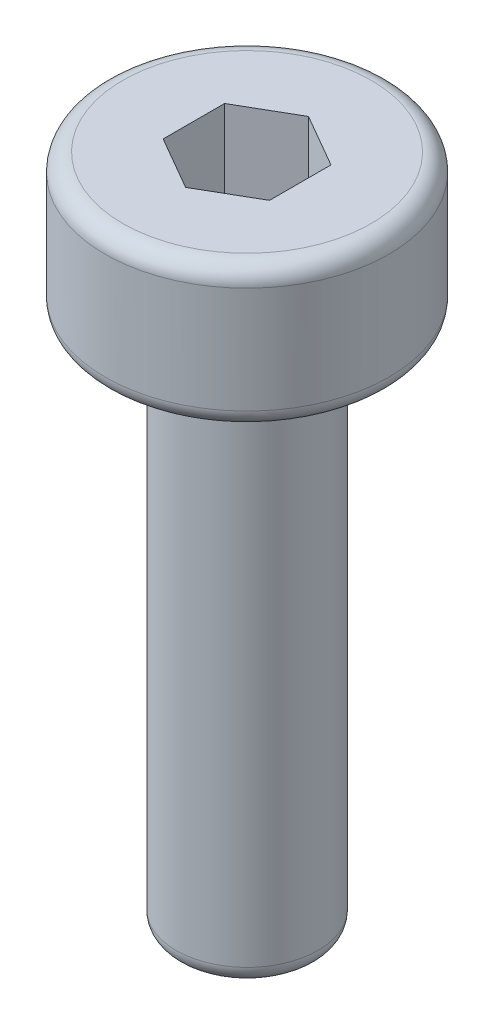
ISO-10303-21;
HEADER;
FILE_DESCRIPTION(('STEP AP214'),'2;1');
FILE_NAME('part.step','',(''),(''),'','','');
FILE_SCHEMA(('AUTOMOTIVE_DESIGN { 1 0 10303 214 1 1 1 1 }'));
ENDSEC;
DATA;
#1=APPLICATION_CONTEXT('core data for automotive mechanical design processes');
#2=APPLICATION_PROTOCOL_DEFINITION('international standard','automotive_design',2000,#1);
#3=PRODUCT_CONTEXT('',#1,'mechanical');
#4=PRODUCT('Part','Part','',(#3));
#5=PRODUCT_RELATED_PRODUCT_CATEGORY('part','',(#4));
#6=PRODUCT_DEFINITION_FORMATION('','',#4);
#7=PRODUCT_DEFINITION_CONTEXT('part definition',#1,'design');
#8=PRODUCT_DEFINITION('design','',#6,#7);
#9=PRODUCT_DEFINITION_SHAPE('','',#8);
#10=(LENGTH_UNIT() NAMED_UNIT(*) SI_UNIT(.MILLI.,.METRE.));
#11=(NAMED_UNIT(*) PLANE_ANGLE_UNIT() SI_UNIT($,.RADIAN.));
#12=(NAMED_UNIT(*) SI_UNIT($,.STERADIAN.) SOLID_ANGLE_UNIT());
#13=UNCERTAINTY_MEASURE_WITH_UNIT(LENGTH_MEASURE(1.E-05),#10,'distance_accuracy_value','');
#14=(GEOMETRIC_REPRESENTATION_CONTEXT(3) GLOBAL_UNCERTAINTY_ASSIGNED_CONTEXT((#13)) GLOBAL_UNIT_ASSIGNED_CONTEXT((#10,
#11,#12)) REPRESENTATION_CONTEXT('',''));
#15=CARTESIAN_POINT('',(0.,0.,0.));
#16=DIRECTION('',(0.,0.,1.));
#17=DIRECTION('',(1.,0.,0.));
#18=AXIS2_PLACEMENT_3D('',#15,#16,#17);
#19=CARTESIAN_POINT('',(-2.,-9.5,0.));
#20=DIRECTION('',(0.,1.,0.));
#21=DIRECTION('',(0.,0.,1.));
#22=AXIS2_PLACEMENT_3D('',#19,#20,#21);
#23=PLANE('',#22);
#24=CARTESIAN_POINT('',(0.,-9.5,0.));
#25=DIRECTION('',(0.,1.,0.));
#26=DIRECTION('',(0.,0.,1.));
#27=AXIS2_PLACEMENT_3D('',#24,#25,#26);
#28=CIRCLE('',#27,1.5);
#29=CARTESIAN_POINT('',(0.,-9.5,1.5));
#30=VERTEX_POINT('',#29);
#31=EDGE_CURVE('E171',#30,#30,#28,.F.);
#32=ORIENTED_EDGE('',*,*,#31,.T.);
#33=EDGE_LOOP('',(#32));
#34=FACE_BOUND('',#33,.T.);
#35=ADVANCED_FACE('F35',(#34),#23,.F.);
#36=CARTESIAN_POINT('',(0.,9.5,0.));
#37=DIRECTION('',(0.,-1.,0.));
#38=DIRECTION('',(0.,0.,-1.));
#39=AXIS2_PLACEMENT_3D('',#36,#37,#38);
#40=PLANE('',#39);
#41=CARTESIAN_POINT('',(0.,9.5,0.));
#42=DIRECTION('',(0.,-1.,0.));
#43=DIRECTION('',(0.,0.,-1.));
#44=AXIS2_PLACEMENT_3D('',#41,#42,#43);
#45=CIRCLE('',#44,3.5);
#46=CARTESIAN_POINT('',(0.,9.5,-3.5));
#47=VERTEX_POINT('',#46);
#48=EDGE_CURVE('E11',#47,#47,#45,.F.);
#49=ORIENTED_EDGE('',*,*,#48,.T.);
#50=EDGE_LOOP('',(#49));
#51=FACE_BOUND('',#50,.T.);
#52=DIRECTION('',(0.,0.,-1.));
#53=VECTOR('',#52,1.);
#54=CARTESIAN_POINT('',(1.5,9.5,0.86602540378444));
#55=LINE('',#54,#53);
#56=CARTESIAN_POINT('',(1.5,9.5,0.86602540378444));
#57=VERTEX_POINT('',#56);
#58=CARTESIAN_POINT('',(1.5,9.5,-0.86602540378444));
#59=VERTEX_POINT('',#58);
#60=EDGE_CURVE('E118',#57,#59,#55,.T.);
#61=ORIENTED_EDGE('',*,*,#60,.F.);
#62=DIRECTION('',(0.866025403784439,0.,-0.5));
#63=VECTOR('',#62,1.);
#64=CARTESIAN_POINT('',(0.,9.5,1.73205080756888));
#65=LINE('',#64,#63);
#66=CARTESIAN_POINT('',(0.,9.5,1.73205080756888));
#67=VERTEX_POINT('',#66);
#68=EDGE_CURVE('E123',#67,#57,#65,.T.);
#69=ORIENTED_EDGE('',*,*,#68,.F.);
#70=DIRECTION('',(0.866025403784439,0.,0.5));
#71=VECTOR('',#70,1.);
#72=CARTESIAN_POINT('',(-1.5,9.5,0.866025403784439));
#73=LINE('',#72,#71);
#74=CARTESIAN_POINT('',(-1.5,9.5,0.866025403784439));
#75=VERTEX_POINT('',#74);
#76=EDGE_CURVE('E136',#75,#67,#73,.T.);
#77=ORIENTED_EDGE('',*,*,#76,.F.);
#78=DIRECTION('',(0.,0.,1.));
#79=VECTOR('',#78,1.);
#80=CARTESIAN_POINT('',(-1.5,9.5,-0.86602540378444));
#81=LINE('',#80,#79);
#82=CARTESIAN_POINT('',(-1.5,9.5,-0.86602540378444));
#83=VERTEX_POINT('',#82);
#84=EDGE_CURVE('E130',#83,#75,#81,.T.);
#85=ORIENTED_EDGE('',*,*,#84,.F.);
#86=DIRECTION('',(-0.866025403784439,0.,0.5));
#87=VECTOR('',#86,1.);
#88=CARTESIAN_POINT('',(0.,9.5,-1.73205080756888));
#89=LINE('',#88,#87);
#90=CARTESIAN_POINT('',(0.,9.5,-1.73205080756888));
#91=VERTEX_POINT('',#90);
#92=EDGE_CURVE('E128',#91,#83,#89,.T.);
#93=ORIENTED_EDGE('',*,*,#92,.F.);
#94=DIRECTION('',(-0.866025403784439,0.,-0.5));
#95=VECTOR('',#94,1.);
#96=CARTESIAN_POINT('',(1.5,9.5,-0.86602540378444));
#97=LINE('',#96,#95);
#98=EDGE_CURVE('E111',#59,#91,#97,.T.);
#99=ORIENTED_EDGE('',*,*,#98,.F.);
#100=EDGE_LOOP('',(#61,#69,#77,#85,#93,#99));
#101=FACE_BOUND('',#100,.T.);
#102=ADVANCED_FACE('F125',(#51,#101),#40,.F.);
#103=CARTESIAN_POINT('',(0.,-9.5,0.));
#104=DIRECTION('',(0.,-1.,0.));
#105=DIRECTION('',(0.,0.,-1.));
#106=AXIS2_PLACEMENT_3D('',#103,#104,#105);
#107=CYLINDRICAL_SURFACE('',#106,4.);
#108=CARTESIAN_POINT('',(0.,6.,0.));
#109=DIRECTION('',(0.,1.,0.));
#110=DIRECTION('',(0.,0.,1.));
#111=AXIS2_PLACEMENT_3D('',#108,#109,#110);
#112=CIRCLE('',#111,4.);
#113=CARTESIAN_POINT('',(0.,6.,4.));
#114=VERTEX_POINT('',#113);
#115=EDGE_CURVE('E44',#114,#114,#112,.T.);
#116=ORIENTED_EDGE('',*,*,#115,.T.);
#117=EDGE_LOOP('',(#116));
#118=FACE_BOUND('',#117,.T.);
#119=CARTESIAN_POINT('',(0.,9.,0.));
#120=DIRECTION('',(0.,-1.,0.));
#121=DIRECTION('',(0.,0.,-1.));
#122=AXIS2_PLACEMENT_3D('',#119,#120,#121);
#123=CIRCLE('',#122,4.);
#124=CARTESIAN_POINT('',(0.,9.,-4.));
#125=VERTEX_POINT('',#124);
#126=EDGE_CURVE('E186',#125,#125,#123,.T.);
#127=ORIENTED_EDGE('',*,*,#126,.T.);
#128=EDGE_LOOP('',(#127));
#129=FACE_BOUND('',#128,.T.);
#130=ADVANCED_FACE('F259',(#118,#129),#107,.T.);
#131=CARTESIAN_POINT('',(-4.,5.5,0.));
#132=DIRECTION('',(0.,1.,0.));
#133=DIRECTION('',(0.,0.,1.));
#134=AXIS2_PLACEMENT_3D('',#131,#132,#133);
#135=PLANE('',#134);
#136=CARTESIAN_POINT('',(0.,5.5,0.));
#137=DIRECTION('',(0.,1.,0.));
#138=DIRECTION('',(0.,0.,1.));
#139=AXIS2_PLACEMENT_3D('',#136,#137,#138);
#140=CIRCLE('',#139,2.5);
#141=CARTESIAN_POINT('',(0.,5.5,2.5));
#142=VERTEX_POINT('',#141);
#143=EDGE_CURVE('E183',#142,#142,#140,.T.);
#144=ORIENTED_EDGE('',*,*,#143,.T.);
#145=EDGE_LOOP('',(#144));
#146=FACE_BOUND('',#145,.T.);
#147=CARTESIAN_POINT('',(0.,5.5,0.));
#148=DIRECTION('',(0.,1.,0.));
#149=DIRECTION('',(0.,0.,1.));
#150=AXIS2_PLACEMENT_3D('',#147,#148,#149);
#151=CIRCLE('',#150,3.5);
#152=CARTESIAN_POINT('',(0.,5.5,3.5));
#153=VERTEX_POINT('',#152);
#154=EDGE_CURVE('E180',#153,#153,#151,.F.);
#155=ORIENTED_EDGE('',*,*,#154,.T.);
#156=EDGE_LOOP('',(#155));
#157=FACE_BOUND('',#156,.T.);
#158=ADVANCED_FACE('F292',(#146,#157),#135,.F.);
#159=CARTESIAN_POINT('',(0.,-9.5,0.));
#160=DIRECTION('',(0.,-1.,0.));
#161=DIRECTION('',(0.,0.,-1.));
#162=AXIS2_PLACEMENT_3D('',#159,#160,#161);
#163=CYLINDRICAL_SURFACE('',#162,2.);
#164=CARTESIAN_POINT('',(0.,-9.,0.));
#165=DIRECTION('',(0.,1.,0.));
#166=DIRECTION('',(0.,0.,1.));
#167=AXIS2_PLACEMENT_3D('',#164,#165,#166);
#168=CIRCLE('',#167,2.);
#169=CARTESIAN_POINT('',(0.,-9.,2.));
#170=VERTEX_POINT('',#169);
#171=EDGE_CURVE('E177',#170,#170,#168,.T.);
#172=ORIENTED_EDGE('',*,*,#171,.T.);
#173=EDGE_LOOP('',(#172));
#174=FACE_BOUND('',#173,.T.);
#175=CARTESIAN_POINT('',(0.,5.,0.));
#176=DIRECTION('',(0.,1.,0.));
#177=DIRECTION('',(0.,0.,1.));
#178=AXIS2_PLACEMENT_3D('',#175,#176,#177);
#179=CIRCLE('',#178,2.);
#180=CARTESIAN_POINT('',(0.,5.,2.));
#181=VERTEX_POINT('',#180);
#182=EDGE_CURVE('E174',#181,#181,#179,.F.);
#183=ORIENTED_EDGE('',*,*,#182,.T.);
#184=EDGE_LOOP('',(#183));
#185=FACE_BOUND('',#184,.T.);
#186=ADVANCED_FACE('F294',(#174,#185),#163,.T.);
#187=CARTESIAN_POINT('',(0.,3.5,1.73205080756888));
#188=DIRECTION('',(0.5,0.,0.866025403784439));
#189=DIRECTION('',(0.866025403784439,0.,-0.5));
#190=AXIS2_PLACEMENT_3D('',#187,#188,#189);
#191=PLANE('',#190);
#192=DIRECTION('',(0.,1.,0.));
#193=VECTOR('',#192,1.);
#194=CARTESIAN_POINT('',(1.5,3.5,0.86602540378444));
#195=LINE('',#194,#193);
#196=CARTESIAN_POINT('',(1.5,4.,0.86602540378444));
#197=VERTEX_POINT('',#196);
#198=EDGE_CURVE('E115',#197,#57,#195,.T.);
#199=ORIENTED_EDGE('',*,*,#198,.F.);
#200=DIRECTION('',(0.866025403784439,0.,-0.5));
#201=VECTOR('',#200,1.);
#202=CARTESIAN_POINT('',(0.,4.,1.73205080756888));
#203=LINE('',#202,#201);
#204=CARTESIAN_POINT('',(0.,4.,1.73205080756888));
#205=VERTEX_POINT('',#204);
#206=EDGE_CURVE('E169',#197,#205,#203,.F.);
#207=ORIENTED_EDGE('',*,*,#206,.T.);
#208=DIRECTION('',(0.,1.,0.));
#209=VECTOR('',#208,1.);
#210=CARTESIAN_POINT('',(0.,3.5,1.73205080756888));
#211=LINE('',#210,#209);
#212=EDGE_CURVE('E139',#205,#67,#211,.T.);
#213=ORIENTED_EDGE('',*,*,#212,.T.);
#214=ORIENTED_EDGE('',*,*,#68,.T.);
#215=EDGE_LOOP('',(#199,#207,#213,#214));
#216=FACE_BOUND('',#215,.T.);
#217=ADVANCED_FACE('F210',(#216),#191,.F.);
#218=CARTESIAN_POINT('',(-1.5,3.5,0.866025403784439));
#219=DIRECTION('',(-0.5,0.,0.866025403784439));
#220=DIRECTION('',(0.866025403784439,0.,0.5));
#221=AXIS2_PLACEMENT_3D('',#218,#219,#220);
#222=PLANE('',#221);
#223=ORIENTED_EDGE('',*,*,#212,.F.);
#224=DIRECTION('',(0.866025403784439,0.,0.5));
#225=VECTOR('',#224,1.);
#226=CARTESIAN_POINT('',(-1.5,4.,0.866025403784439));
#227=LINE('',#226,#225);
#228=CARTESIAN_POINT('',(-1.5,4.,0.866025403784439));
#229=VERTEX_POINT('',#228);
#230=EDGE_CURVE('E160',#205,#229,#227,.F.);
#231=ORIENTED_EDGE('',*,*,#230,.T.);
#232=DIRECTION('',(0.,1.,0.));
#233=VECTOR('',#232,1.);
#234=CARTESIAN_POINT('',(-1.5,3.5,0.866025403784439));
#235=LINE('',#234,#233);
#236=EDGE_CURVE('E142',#229,#75,#235,.T.);
#237=ORIENTED_EDGE('',*,*,#236,.T.);
#238=ORIENTED_EDGE('',*,*,#76,.T.);
#239=EDGE_LOOP('',(#223,#231,#237,#238));
#240=FACE_BOUND('',#239,.T.);
#241=ADVANCED_FACE('F215',(#240),#222,.F.);
#242=CARTESIAN_POINT('',(-1.5,3.5,-0.86602540378444));
#243=DIRECTION('',(-1.,0.,0.));
#244=DIRECTION('',(0.,0.,1.));
#245=AXIS2_PLACEMENT_3D('',#242,#243,#244);
#246=PLANE('',#245);
#247=ORIENTED_EDGE('',*,*,#236,.F.);
#248=DIRECTION('',(0.,0.,1.));
#249=VECTOR('',#248,1.);
#250=CARTESIAN_POINT('',(-1.5,4.,-0.86602540378444));
#251=LINE('',#250,#249);
#252=CARTESIAN_POINT('',(-1.5,4.,-0.86602540378444));
#253=VERTEX_POINT('',#252);
#254=EDGE_CURVE('E163',#229,#253,#251,.F.);
#255=ORIENTED_EDGE('',*,*,#254,.T.);
#256=DIRECTION('',(0.,1.,0.));
#257=VECTOR('',#256,1.);
#258=CARTESIAN_POINT('',(-1.5,3.5,-0.86602540378444));
#259=LINE('',#258,#257);
#260=EDGE_CURVE('E144',#253,#83,#259,.T.);
#261=ORIENTED_EDGE('',*,*,#260,.T.);
#262=ORIENTED_EDGE('',*,*,#84,.T.);
#263=EDGE_LOOP('',(#247,#255,#261,#262));
#264=FACE_BOUND('',#263,.T.);
#265=ADVANCED_FACE('F219',(#264),#246,.F.);
#266=CARTESIAN_POINT('',(0.,3.5,-1.73205080756888));
#267=DIRECTION('',(-0.5,0.,-0.866025403784438));
#268=DIRECTION('',(-0.866025403784439,0.,0.5));
#269=AXIS2_PLACEMENT_3D('',#266,#267,#268);
#270=PLANE('',#269);
#271=ORIENTED_EDGE('',*,*,#260,.F.);
#272=DIRECTION('',(-0.866025403784439,0.,0.5));
#273=VECTOR('',#272,1.);
#274=CARTESIAN_POINT('',(0.,4.,-1.73205080756888));
#275=LINE('',#274,#273);
#276=CARTESIAN_POINT('',(0.,4.,-1.73205080756888));
#277=VERTEX_POINT('',#276);
#278=EDGE_CURVE('E165',#253,#277,#275,.F.);
#279=ORIENTED_EDGE('',*,*,#278,.T.);
#280=DIRECTION('',(0.,1.,0.));
#281=VECTOR('',#280,1.);
#282=CARTESIAN_POINT('',(0.,3.5,-1.73205080756888));
#283=LINE('',#282,#281);
#284=EDGE_CURVE('E114',#277,#91,#283,.T.);
#285=ORIENTED_EDGE('',*,*,#284,.T.);
#286=ORIENTED_EDGE('',*,*,#92,.T.);
#287=EDGE_LOOP('',(#271,#279,#285,#286));
#288=FACE_BOUND('',#287,.T.);
#289=ADVANCED_FACE('F223',(#288),#270,.F.);
#290=CARTESIAN_POINT('',(1.5,3.5,-0.86602540378444));
#291=DIRECTION('',(0.5,0.,-0.866025403784439));
#292=DIRECTION('',(-0.866025403784439,0.,-0.5));
#293=AXIS2_PLACEMENT_3D('',#290,#291,#292);
#294=PLANE('',#293);
#295=ORIENTED_EDGE('',*,*,#284,.F.);
#296=DIRECTION('',(-0.866025403784439,0.,-0.5));
#297=VECTOR('',#296,1.);
#298=CARTESIAN_POINT('',(1.5,4.,-0.86602540378444));
#299=LINE('',#298,#297);
#300=CARTESIAN_POINT('',(1.5,4.,-0.86602540378444));
#301=VERTEX_POINT('',#300);
#302=EDGE_CURVE('E60',#277,#301,#299,.F.);
#303=ORIENTED_EDGE('',*,*,#302,.T.);
#304=DIRECTION('',(0.,1.,0.));
#305=VECTOR('',#304,1.);
#306=CARTESIAN_POINT('',(1.5,3.5,-0.86602540378444));
#307=LINE('',#306,#305);
#308=EDGE_CURVE('E107',#301,#59,#307,.T.);
#309=ORIENTED_EDGE('',*,*,#308,.T.);
#310=ORIENTED_EDGE('',*,*,#98,.T.);
#311=EDGE_LOOP('',(#295,#303,#309,#310));
#312=FACE_BOUND('',#311,.T.);
#313=ADVANCED_FACE('F109',(#312),#294,.F.);
#314=CARTESIAN_POINT('',(1.5,3.5,0.86602540378444));
#315=DIRECTION('',(1.,0.,0.));
#316=DIRECTION('',(0.,0.,-1.));
#317=AXIS2_PLACEMENT_3D('',#314,#315,#316);
#318=PLANE('',#317);
#319=ORIENTED_EDGE('',*,*,#308,.F.);
#320=DIRECTION('',(0.,0.,-1.));
#321=VECTOR('',#320,1.);
#322=CARTESIAN_POINT('',(1.5,4.,0.86602540378444));
#323=LINE('',#322,#321);
#324=EDGE_CURVE('E52',#301,#197,#323,.F.);
#325=ORIENTED_EDGE('',*,*,#324,.T.);
#326=ORIENTED_EDGE('',*,*,#198,.T.);
#327=ORIENTED_EDGE('',*,*,#60,.T.);
#328=EDGE_LOOP('',(#319,#325,#326,#327));
#329=FACE_BOUND('',#328,.T.);
#330=ADVANCED_FACE('F119',(#329),#318,.F.);
#331=CARTESIAN_POINT('',(0.,3.5,0.));
#332=DIRECTION('',(0.,1.,0.));
#333=DIRECTION('',(0.,0.,1.));
#334=AXIS2_PLACEMENT_3D('',#331,#332,#333);
#335=PLANE('',#334);
#336=DIRECTION('',(0.,0.,1.));
#337=VECTOR('',#336,1.);
#338=CARTESIAN_POINT('',(-1.,3.5,0.));
#339=LINE('',#338,#337);
#340=CARTESIAN_POINT('',(-1.,3.5,-0.577350269189627));
#341=VERTEX_POINT('',#340);
#342=CARTESIAN_POINT('',(-1.,3.5,0.577350269189626));
#343=VERTEX_POINT('',#342);
#344=EDGE_CURVE('E155',#341,#343,#339,.T.);
#345=ORIENTED_EDGE('',*,*,#344,.T.);
#346=DIRECTION('',(0.866025403784439,0.,0.5));
#347=VECTOR('',#346,1.);
#348=CARTESIAN_POINT('',(-0.5,3.5,0.866025403784439));
#349=LINE('',#348,#347);
#350=CARTESIAN_POINT('',(0.,3.5,1.15470053837925));
#351=VERTEX_POINT('',#350);
#352=EDGE_CURVE('E157',#343,#351,#349,.T.);
#353=ORIENTED_EDGE('',*,*,#352,.T.);
#354=DIRECTION('',(0.866025403784439,0.,-0.5));
#355=VECTOR('',#354,1.);
#356=CARTESIAN_POINT('',(0.5,3.5,0.866025403784439));
#357=LINE('',#356,#355);
#358=CARTESIAN_POINT('',(1.,3.5,0.577350269189627));
#359=VERTEX_POINT('',#358);
#360=EDGE_CURVE('E141',#351,#359,#357,.T.);
#361=ORIENTED_EDGE('',*,*,#360,.T.);
#362=DIRECTION('',(0.,0.,-1.));
#363=VECTOR('',#362,1.);
#364=CARTESIAN_POINT('',(1.,3.5,0.));
#365=LINE('',#364,#363);
#366=CARTESIAN_POINT('',(1.,3.5,-0.577350269189627));
#367=VERTEX_POINT('',#366);
#368=EDGE_CURVE('E149',#359,#367,#365,.T.);
#369=ORIENTED_EDGE('',*,*,#368,.T.);
#370=DIRECTION('',(-0.866025403784439,0.,-0.5));
#371=VECTOR('',#370,1.);
#372=CARTESIAN_POINT('',(0.500000000000001,3.5,-0.86602540378444));
#373=LINE('',#372,#371);
#374=CARTESIAN_POINT('',(0.,3.5,-1.15470053837925));
#375=VERTEX_POINT('',#374);
#376=EDGE_CURVE('E151',#367,#375,#373,.T.);
#377=ORIENTED_EDGE('',*,*,#376,.T.);
#378=DIRECTION('',(-0.866025403784439,0.,0.5));
#379=VECTOR('',#378,1.);
#380=CARTESIAN_POINT('',(-0.500000000000001,3.5,-0.86602540378444));
#381=LINE('',#380,#379);
#382=EDGE_CURVE('E153',#375,#341,#381,.T.);
#383=ORIENTED_EDGE('',*,*,#382,.T.);
#384=EDGE_LOOP('',(#345,#353,#361,#369,#377,#383));
#385=FACE_BOUND('',#384,.T.);
#386=ADVANCED_FACE('F243',(#385),#335,.T.);
#387=CARTESIAN_POINT('',(0.500000000000001,4.,-0.86602540378444));
#388=DIRECTION('',(-0.866025403784439,0.,-0.5));
#389=DIRECTION('',(-0.5,0.,0.866025403784439));
#390=AXIS2_PLACEMENT_3D('',#387,#388,#389);
#391=CYLINDRICAL_SURFACE('',#390,0.5);
#392=CARTESIAN_POINT('',(1.,4.,-0.577350269189627));
#393=DIRECTION('',(-0.5,0.,-0.866025403784439));
#394=DIRECTION('',(-0.866025403784439,0.,0.5));
#395=AXIS2_PLACEMENT_3D('',#392,#393,#394);
#396=ELLIPSE('',#395,0.577350269189626,0.5);
#397=EDGE_CURVE('E200',#301,#367,#396,.T.);
#398=ORIENTED_EDGE('',*,*,#397,.F.);
#399=ORIENTED_EDGE('',*,*,#302,.F.);
#400=CARTESIAN_POINT('',(0.,4.,-1.15470053837925));
#401=DIRECTION('',(-1.,0.,0.));
#402=DIRECTION('',(0.,0.,1.));
#403=AXIS2_PLACEMENT_3D('',#400,#401,#402);
#404=ELLIPSE('',#403,0.577350269189626,0.5);
#405=EDGE_CURVE('E39',#375,#277,#404,.F.);
#406=ORIENTED_EDGE('',*,*,#405,.F.);
#407=ORIENTED_EDGE('',*,*,#376,.F.);
#408=EDGE_LOOP('',(#398,#399,#406,#407));
#409=FACE_BOUND('',#408,.T.);
#410=ADVANCED_FACE('F225',(#409),#391,.F.);
#411=CARTESIAN_POINT('',(-0.500000000000001,4.,-0.86602540378444));
#412=DIRECTION('',(-0.866025403784439,0.,0.5));
#413=DIRECTION('',(0.5,0.,0.866025403784439));
#414=AXIS2_PLACEMENT_3D('',#411,#412,#413);
#415=CYLINDRICAL_SURFACE('',#414,0.5);
#416=ORIENTED_EDGE('',*,*,#405,.T.);
#417=ORIENTED_EDGE('',*,*,#278,.F.);
#418=CARTESIAN_POINT('',(-1.,4.,-0.577350269189627));
#419=DIRECTION('',(-0.5,0.,0.866025403784439));
#420=DIRECTION('',(0.866025403784439,0.,0.5));
#421=AXIS2_PLACEMENT_3D('',#418,#419,#420);
#422=ELLIPSE('',#421,0.577350269189626,0.5);
#423=EDGE_CURVE('E198',#341,#253,#422,.F.);
#424=ORIENTED_EDGE('',*,*,#423,.F.);
#425=ORIENTED_EDGE('',*,*,#382,.F.);
#426=EDGE_LOOP('',(#416,#417,#424,#425));
#427=FACE_BOUND('',#426,.T.);
#428=ADVANCED_FACE('F241',(#427),#415,.F.);
#429=CARTESIAN_POINT('',(1.,4.,0.));
#430=DIRECTION('',(0.,0.,-1.));
#431=DIRECTION('',(-1.,0.,0.));
#432=AXIS2_PLACEMENT_3D('',#429,#430,#431);
#433=CYLINDRICAL_SURFACE('',#432,0.5);
#434=ORIENTED_EDGE('',*,*,#397,.T.);
#435=ORIENTED_EDGE('',*,*,#368,.F.);
#436=CARTESIAN_POINT('',(1.,4.,0.577350269189627));
#437=DIRECTION('',(0.5,0.,-0.866025403784439));
#438=DIRECTION('',(-0.866025403784439,0.,-0.5));
#439=AXIS2_PLACEMENT_3D('',#436,#437,#438);
#440=ELLIPSE('',#439,0.577350269189626,0.5);
#441=EDGE_CURVE('E195',#197,#359,#440,.T.);
#442=ORIENTED_EDGE('',*,*,#441,.F.);
#443=ORIENTED_EDGE('',*,*,#324,.F.);
#444=EDGE_LOOP('',(#434,#435,#442,#443));
#445=FACE_BOUND('',#444,.T.);
#446=ADVANCED_FACE('F227',(#445),#433,.F.);
#447=CARTESIAN_POINT('',(-1.,4.,0.));
#448=DIRECTION('',(0.,0.,1.));
#449=DIRECTION('',(1.,0.,0.));
#450=AXIS2_PLACEMENT_3D('',#447,#448,#449);
#451=CYLINDRICAL_SURFACE('',#450,0.5);
#452=ORIENTED_EDGE('',*,*,#423,.T.);
#453=ORIENTED_EDGE('',*,*,#254,.F.);
#454=CARTESIAN_POINT('',(-1.,4.,0.577350269189626));
#455=DIRECTION('',(0.5,0.,0.866025403784439));
#456=DIRECTION('',(0.866025403784439,0.,-0.5));
#457=AXIS2_PLACEMENT_3D('',#454,#455,#456);
#458=ELLIPSE('',#457,0.577350269189626,0.5);
#459=EDGE_CURVE('E193',#343,#229,#458,.F.);
#460=ORIENTED_EDGE('',*,*,#459,.F.);
#461=ORIENTED_EDGE('',*,*,#344,.F.);
#462=EDGE_LOOP('',(#452,#453,#460,#461));
#463=FACE_BOUND('',#462,.T.);
#464=ADVANCED_FACE('F239',(#463),#451,.F.);
#465=CARTESIAN_POINT('',(0.5,4.,0.866025403784439));
#466=DIRECTION('',(0.866025403784439,0.,-0.5));
#467=DIRECTION('',(-0.5,0.,-0.866025403784439));
#468=AXIS2_PLACEMENT_3D('',#465,#466,#467);
#469=CYLINDRICAL_SURFACE('',#468,0.5);
#470=ORIENTED_EDGE('',*,*,#441,.T.);
#471=ORIENTED_EDGE('',*,*,#360,.F.);
#472=CARTESIAN_POINT('',(0.,4.,1.15470053837925));
#473=DIRECTION('',(1.,0.,0.));
#474=DIRECTION('',(0.,0.,1.));
#475=AXIS2_PLACEMENT_3D('',#472,#473,#474);
#476=ELLIPSE('',#475,0.577350269189626,0.5);
#477=EDGE_CURVE('E191',#205,#351,#476,.T.);
#478=ORIENTED_EDGE('',*,*,#477,.F.);
#479=ORIENTED_EDGE('',*,*,#206,.F.);
#480=EDGE_LOOP('',(#470,#471,#478,#479));
#481=FACE_BOUND('',#480,.T.);
#482=ADVANCED_FACE('F232',(#481),#469,.F.);
#483=CARTESIAN_POINT('',(-0.5,4.,0.866025403784439));
#484=DIRECTION('',(0.866025403784439,0.,0.5));
#485=DIRECTION('',(0.5,0.,-0.866025403784439));
#486=AXIS2_PLACEMENT_3D('',#483,#484,#485);
#487=CYLINDRICAL_SURFACE('',#486,0.5);
#488=ORIENTED_EDGE('',*,*,#459,.T.);
#489=ORIENTED_EDGE('',*,*,#230,.F.);
#490=ORIENTED_EDGE('',*,*,#477,.T.);
#491=ORIENTED_EDGE('',*,*,#352,.F.);
#492=EDGE_LOOP('',(#488,#489,#490,#491));
#493=FACE_BOUND('',#492,.T.);
#494=ADVANCED_FACE('F235',(#493),#487,.F.);
#495=CARTESIAN_POINT('',(0.,-9.,0.));
#496=DIRECTION('',(0.,1.,0.));
#497=DIRECTION('',(0.,0.,1.));
#498=AXIS2_PLACEMENT_3D('',#495,#496,#497);
#499=TOROIDAL_SURFACE('',#498,1.5,0.5);
#500=ORIENTED_EDGE('',*,*,#171,.F.);
#501=EDGE_LOOP('',(#500));
#502=FACE_BOUND('',#501,.T.);
#503=ORIENTED_EDGE('',*,*,#31,.F.);
#504=EDGE_LOOP('',(#503));
#505=FACE_BOUND('',#504,.T.);
#506=ADVANCED_FACE('F266',(#502,#505),#499,.T.);
#507=CARTESIAN_POINT('',(0.,5.,0.));
#508=DIRECTION('',(0.,1.,0.));
#509=DIRECTION('',(0.,0.,1.));
#510=AXIS2_PLACEMENT_3D('',#507,#508,#509);
#511=TOROIDAL_SURFACE('',#510,2.5,0.5);
#512=ORIENTED_EDGE('',*,*,#143,.F.);
#513=EDGE_LOOP('',(#512));
#514=FACE_BOUND('',#513,.T.);
#515=ORIENTED_EDGE('',*,*,#182,.F.);
#516=EDGE_LOOP('',(#515));
#517=FACE_BOUND('',#516,.T.);
#518=ADVANCED_FACE('F277',(#514,#517),#511,.F.);
#519=CARTESIAN_POINT('',(0.,6.,0.));
#520=DIRECTION('',(0.,1.,0.));
#521=DIRECTION('',(0.,0.,1.));
#522=AXIS2_PLACEMENT_3D('',#519,#520,#521);
#523=TOROIDAL_SURFACE('',#522,3.5,0.5);
#524=ORIENTED_EDGE('',*,*,#115,.F.);
#525=EDGE_LOOP('',(#524));
#526=FACE_BOUND('',#525,.T.);
#527=ORIENTED_EDGE('',*,*,#154,.F.);
#528=EDGE_LOOP('',(#527));
#529=FACE_BOUND('',#528,.T.);
#530=ADVANCED_FACE('F280',(#526,#529),#523,.T.);
#531=CARTESIAN_POINT('',(0.,9.,0.));
#532=DIRECTION('',(0.,-1.,0.));
#533=DIRECTION('',(0.,0.,-1.));
#534=AXIS2_PLACEMENT_3D('',#531,#532,#533);
#535=TOROIDAL_SURFACE('',#534,3.5,0.5);
#536=ORIENTED_EDGE('',*,*,#48,.F.);
#537=EDGE_LOOP('',(#536));
#538=FACE_BOUND('',#537,.T.);
#539=ORIENTED_EDGE('',*,*,#126,.F.);
#540=EDGE_LOOP('',(#539));
#541=FACE_BOUND('',#540,.T.);
#542=ADVANCED_FACE('F37',(#538,#541),#535,.T.);
#543=CLOSED_SHELL('',(#35,#102,#130,#158,#186,#217,#241,#265,#289,#313,#330,#386,#410,#428,#446,
#464,#482,#494,#506,#518,#530,#542));
#544=MANIFOLD_SOLID_BREP('B2',#543);
#545=ADVANCED_BREP_SHAPE_REPRESENTATION('',(#18,#544),#14);
#546=SHAPE_DEFINITION_REPRESENTATION(#9,#545);
ENDSEC;
END-ISO-10303-21;
